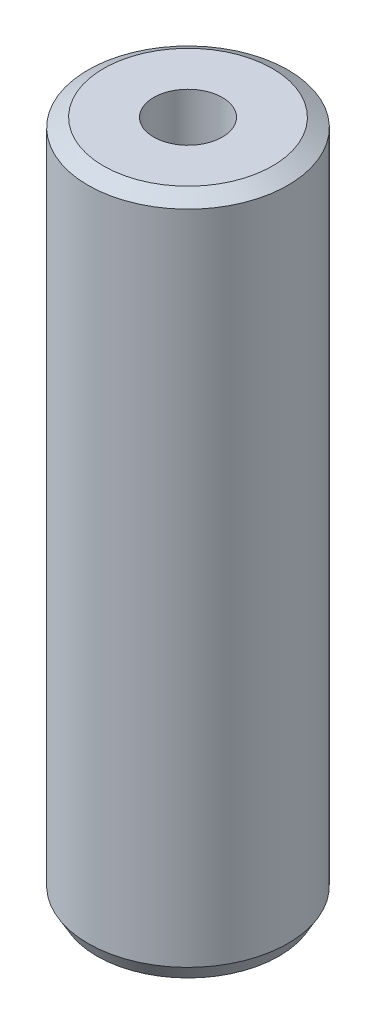
ISO-10303-21;
HEADER;
FILE_DESCRIPTION(('STEP AP214'),'2;1');
FILE_NAME('part.step','',(''),(''),'','','');
FILE_SCHEMA(('AUTOMOTIVE_DESIGN { 1 0 10303 214 1 1 1 1 }'));
ENDSEC;
DATA;
#1=APPLICATION_CONTEXT('core data for automotive mechanical design processes');
#2=APPLICATION_PROTOCOL_DEFINITION('international standard','automotive_design',2000,#1);
#3=PRODUCT_CONTEXT('',#1,'mechanical');
#4=PRODUCT('Part','Part','',(#3));
#5=PRODUCT_RELATED_PRODUCT_CATEGORY('part','',(#4));
#6=PRODUCT_DEFINITION_FORMATION('','',#4);
#7=PRODUCT_DEFINITION_CONTEXT('part definition',#1,'design');
#8=PRODUCT_DEFINITION('design','',#6,#7);
#9=PRODUCT_DEFINITION_SHAPE('','',#8);
#10=(LENGTH_UNIT() NAMED_UNIT(*) SI_UNIT(.MILLI.,.METRE.));
#11=(NAMED_UNIT(*) PLANE_ANGLE_UNIT() SI_UNIT($,.RADIAN.));
#12=(NAMED_UNIT(*) SI_UNIT($,.STERADIAN.) SOLID_ANGLE_UNIT());
#13=UNCERTAINTY_MEASURE_WITH_UNIT(LENGTH_MEASURE(1.E-05),#10,'distance_accuracy_value','');
#14=(GEOMETRIC_REPRESENTATION_CONTEXT(3) GLOBAL_UNCERTAINTY_ASSIGNED_CONTEXT((#13)) GLOBAL_UNIT_ASSIGNED_CONTEXT((#10,
#11,#12)) REPRESENTATION_CONTEXT('',''));
#15=CARTESIAN_POINT('',(0.,0.,0.));
#16=DIRECTION('',(0.,0.,1.));
#17=DIRECTION('',(1.,0.,0.));
#18=AXIS2_PLACEMENT_3D('',#15,#16,#17);
#19=CARTESIAN_POINT('',(0.,204.390626402462,0.));
#20=DIRECTION('',(0.,-1.,0.));
#21=DIRECTION('',(0.,0.,-1.));
#22=AXIS2_PLACEMENT_3D('',#19,#20,#21);
#23=CYLINDRICAL_SURFACE('',#22,30.);
#24=CARTESIAN_POINT('',(0.,201.706001441711,0.));
#25=DIRECTION('',(0.,1.,0.));
#26=DIRECTION('',(0.,0.,1.));
#27=AXIS2_PLACEMENT_3D('',#24,#25,#26);
#28=CIRCLE('',#27,30.);
#29=CARTESIAN_POINT('',(0.,201.706001441711,30.));
#30=VERTEX_POINT('',#29);
#31=EDGE_CURVE('E50',#30,#30,#28,.F.);
#32=ORIENTED_EDGE('',*,*,#31,.T.);
#33=EDGE_LOOP('',(#32));
#34=FACE_BOUND('',#33,.T.);
#35=CARTESIAN_POINT('',(0.,4.64990683128852,0.));
#36=DIRECTION('',(0.,1.,0.));
#37=DIRECTION('',(0.,0.,1.));
#38=AXIS2_PLACEMENT_3D('',#35,#36,#37);
#39=CIRCLE('',#38,30.);
#40=CARTESIAN_POINT('',(0.,4.64990683128852,30.));
#41=VERTEX_POINT('',#40);
#42=EDGE_CURVE('E51',#41,#41,#39,.T.);
#43=ORIENTED_EDGE('',*,*,#42,.T.);
#44=EDGE_LOOP('',(#43));
#45=FACE_BOUND('',#44,.T.);
#46=ADVANCED_FACE('F39',(#34,#45),#23,.T.);
#47=CARTESIAN_POINT('',(0.,204.390626402462,0.));
#48=DIRECTION('',(0.,1.,0.));
#49=DIRECTION('',(0.,0.,1.));
#50=AXIS2_PLACEMENT_3D('',#47,#48,#49);
#51=PLANE('',#50);
#52=CARTESIAN_POINT('',(0.,204.390626402462,0.));
#53=DIRECTION('',(0.,1.,0.));
#54=DIRECTION('',(0.,0.,1.));
#55=AXIS2_PLACEMENT_3D('',#52,#53,#54);
#56=CIRCLE('',#55,25.3500931687115);
#57=CARTESIAN_POINT('',(0.,204.390626402462,25.3500931687115));
#58=VERTEX_POINT('',#57);
#59=EDGE_CURVE('E54',#58,#58,#56,.T.);
#60=ORIENTED_EDGE('',*,*,#59,.T.);
#61=EDGE_LOOP('',(#60));
#62=FACE_BOUND('',#61,.T.);
#63=CARTESIAN_POINT('',(0.,204.390626402462,0.));
#64=DIRECTION('',(0.,1.,0.));
#65=DIRECTION('',(0.,0.,1.));
#66=AXIS2_PLACEMENT_3D('',#63,#64,#65);
#67=CIRCLE('',#66,10.304783990701);
#68=CARTESIAN_POINT('',(0.,204.390626402462,10.304783990701));
#69=VERTEX_POINT('',#68);
#70=EDGE_CURVE('E58',#69,#69,#67,.T.);
#71=ORIENTED_EDGE('',*,*,#70,.F.);
#72=EDGE_LOOP('',(#71));
#73=FACE_BOUND('',#72,.T.);
#74=ADVANCED_FACE('F69',(#62,#73),#51,.T.);
#75=CARTESIAN_POINT('',(0.,0.,0.));
#76=DIRECTION('',(0.,1.,0.));
#77=DIRECTION('',(0.,0.,1.));
#78=AXIS2_PLACEMENT_3D('',#75,#76,#77);
#79=PLANE('',#78);
#80=CARTESIAN_POINT('',(0.,0.,0.));
#81=DIRECTION('',(0.,1.,0.));
#82=DIRECTION('',(0.,0.,1.));
#83=AXIS2_PLACEMENT_3D('',#80,#81,#82);
#84=CIRCLE('',#83,27.3153750392489);
#85=CARTESIAN_POINT('',(0.,0.,27.3153750392489));
#86=VERTEX_POINT('',#85);
#87=EDGE_CURVE('E10',#86,#86,#84,.F.);
#88=ORIENTED_EDGE('',*,*,#87,.T.);
#89=EDGE_LOOP('',(#88));
#90=FACE_BOUND('',#89,.T.);
#91=CARTESIAN_POINT('',(0.,0.,0.));
#92=DIRECTION('',(0.,1.,0.));
#93=DIRECTION('',(0.,0.,1.));
#94=AXIS2_PLACEMENT_3D('',#91,#92,#93);
#95=CIRCLE('',#94,10.304783990701);
#96=CARTESIAN_POINT('',(0.,0.,10.304783990701));
#97=VERTEX_POINT('',#96);
#98=EDGE_CURVE('E63',#97,#97,#95,.T.);
#99=ORIENTED_EDGE('',*,*,#98,.T.);
#100=EDGE_LOOP('',(#99));
#101=FACE_BOUND('',#100,.T.);
#102=ADVANCED_FACE('F75',(#90,#101),#79,.F.);
#103=CARTESIAN_POINT('',(0.,204.390626402462,0.));
#104=DIRECTION('',(0.,-1.,0.));
#105=DIRECTION('',(0.,0.,-1.));
#106=AXIS2_PLACEMENT_3D('',#103,#104,#105);
#107=CYLINDRICAL_SURFACE('',#106,10.304783990701);
#108=ORIENTED_EDGE('',*,*,#70,.T.);
#109=EDGE_LOOP('',(#108));
#110=FACE_BOUND('',#109,.T.);
#111=ORIENTED_EDGE('',*,*,#98,.F.);
#112=EDGE_LOOP('',(#111));
#113=FACE_BOUND('',#112,.T.);
#114=ADVANCED_FACE('F70',(#110,#113),#107,.F.);
#115=CARTESIAN_POINT('',(0.,204.390626402462,0.));
#116=DIRECTION('',(0.,-1.,0.));
#117=DIRECTION('',(0.,0.,-1.));
#118=AXIS2_PLACEMENT_3D('',#115,#116,#117);
#119=CONICAL_SURFACE('',#118,25.3500931687115,1.04719755119659);
#120=ORIENTED_EDGE('',*,*,#31,.F.);
#121=EDGE_LOOP('',(#120));
#122=FACE_BOUND('',#121,.T.);
#123=ORIENTED_EDGE('',*,*,#59,.F.);
#124=EDGE_LOOP('',(#123));
#125=FACE_BOUND('',#124,.T.);
#126=ADVANCED_FACE('F81',(#122,#125),#119,.T.);
#127=CARTESIAN_POINT('',(0.,4.64990683128852,0.));
#128=DIRECTION('',(0.,1.,0.));
#129=DIRECTION('',(0.,0.,1.));
#130=AXIS2_PLACEMENT_3D('',#127,#128,#129);
#131=CONICAL_SURFACE('',#130,30.,0.5235987755983);
#132=ORIENTED_EDGE('',*,*,#87,.F.);
#133=EDGE_LOOP('',(#132));
#134=FACE_BOUND('',#133,.T.);
#135=ORIENTED_EDGE('',*,*,#42,.F.);
#136=EDGE_LOOP('',(#135));
#137=FACE_BOUND('',#136,.T.);
#138=ADVANCED_FACE('F45',(#134,#137),#131,.T.);
#139=CLOSED_SHELL('',(#46,#74,#102,#114,#126,#138));
#140=MANIFOLD_SOLID_BREP('B2',#139);
#141=ADVANCED_BREP_SHAPE_REPRESENTATION('',(#18,#140),#14);
#142=SHAPE_DEFINITION_REPRESENTATION(#9,#141);
ENDSEC;
END-ISO-10303-21;
